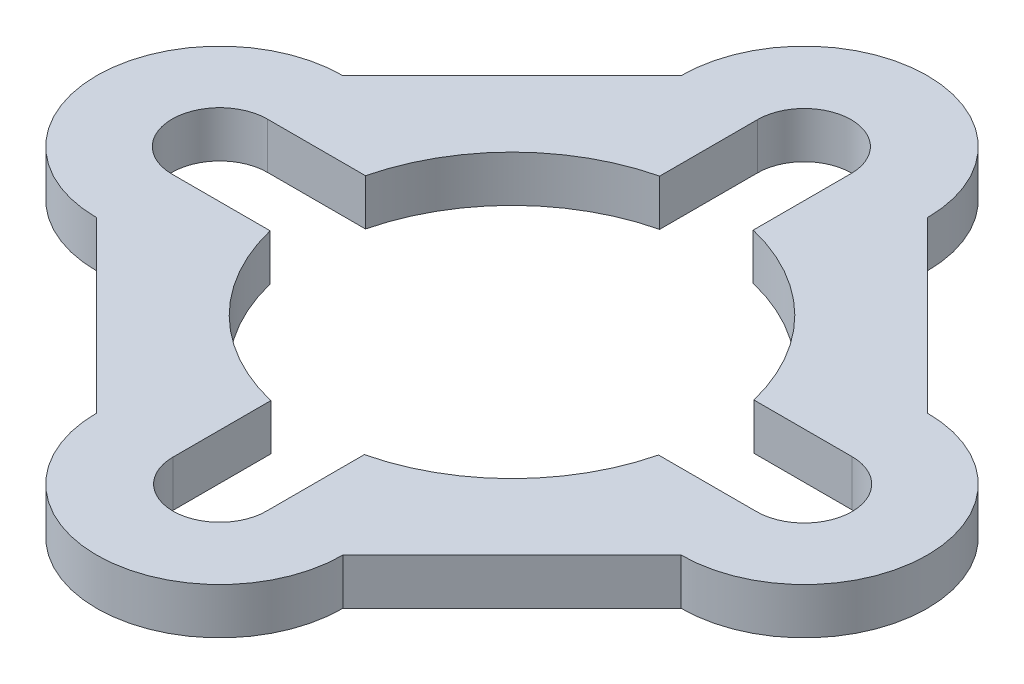
ISO-10303-21;
HEADER;
FILE_DESCRIPTION(('STEP AP214'),'2;1');
FILE_NAME('part.step','',(''),(''),'','','');
FILE_SCHEMA(('AUTOMOTIVE_DESIGN { 1 0 10303 214 1 1 1 1 }'));
ENDSEC;
DATA;
#1=APPLICATION_CONTEXT('core data for automotive mechanical design processes');
#2=APPLICATION_PROTOCOL_DEFINITION('international standard','automotive_design',2000,#1);
#3=PRODUCT_CONTEXT('',#1,'mechanical');
#4=PRODUCT('Part','Part','',(#3));
#5=PRODUCT_RELATED_PRODUCT_CATEGORY('part','',(#4));
#6=PRODUCT_DEFINITION_FORMATION('','',#4);
#7=PRODUCT_DEFINITION_CONTEXT('part definition',#1,'design');
#8=PRODUCT_DEFINITION('design','',#6,#7);
#9=PRODUCT_DEFINITION_SHAPE('','',#8);
#10=(LENGTH_UNIT() NAMED_UNIT(*) SI_UNIT(.MILLI.,.METRE.));
#11=(NAMED_UNIT(*) PLANE_ANGLE_UNIT() SI_UNIT($,.RADIAN.));
#12=(NAMED_UNIT(*) SI_UNIT($,.STERADIAN.) SOLID_ANGLE_UNIT());
#13=UNCERTAINTY_MEASURE_WITH_UNIT(LENGTH_MEASURE(1.E-05),#10,'distance_accuracy_value','');
#14=(GEOMETRIC_REPRESENTATION_CONTEXT(3) GLOBAL_UNCERTAINTY_ASSIGNED_CONTEXT((#13)) GLOBAL_UNIT_ASSIGNED_CONTEXT((#10,
#11,#12)) REPRESENTATION_CONTEXT('',''));
#15=CARTESIAN_POINT('',(0.,0.,0.));
#16=DIRECTION('',(0.,0.,1.));
#17=DIRECTION('',(1.,0.,0.));
#18=AXIS2_PLACEMENT_3D('',#15,#16,#17);
#19=CARTESIAN_POINT('',(6.75,1.5,6.75));
#20=DIRECTION('',(-0.707106781186548,0.,-0.707106781186547));
#21=DIRECTION('',(-0.707106781186547,0.,0.707106781186548));
#22=AXIS2_PLACEMENT_3D('',#19,#20,#21);
#23=PLANE('',#22);
#24=DIRECTION('',(0.707106781186547,0.,-0.707106781186548));
#25=VECTOR('',#24,1.);
#26=CARTESIAN_POINT('',(6.75,0.,6.75));
#27=LINE('',#26,#25);
#28=CARTESIAN_POINT('',(4.00000000000001,0.,9.5));
#29=VERTEX_POINT('',#28);
#30=CARTESIAN_POINT('',(9.5,0.,4.));
#31=VERTEX_POINT('',#30);
#32=EDGE_CURVE('E285',#29,#31,#27,.T.);
#33=ORIENTED_EDGE('',*,*,#32,.T.);
#34=DIRECTION('',(0.,-1.,0.));
#35=VECTOR('',#34,1.);
#36=CARTESIAN_POINT('',(9.5,1.5,4.));
#37=LINE('',#36,#35);
#38=CARTESIAN_POINT('',(9.5,1.5,4.));
#39=VERTEX_POINT('',#38);
#40=EDGE_CURVE('E11',#39,#31,#37,.T.);
#41=ORIENTED_EDGE('',*,*,#40,.F.);
#42=DIRECTION('',(0.707106781186547,0.,-0.707106781186548));
#43=VECTOR('',#42,1.);
#44=CARTESIAN_POINT('',(6.75,1.5,6.75));
#45=LINE('',#44,#43);
#46=CARTESIAN_POINT('',(4.00000000000001,1.5,9.5));
#47=VERTEX_POINT('',#46);
#48=EDGE_CURVE('E428',#47,#39,#45,.T.);
#49=ORIENTED_EDGE('',*,*,#48,.F.);
#50=DIRECTION('',(0.,-1.,0.));
#51=VECTOR('',#50,1.);
#52=CARTESIAN_POINT('',(4.00000000000001,1.5,9.5));
#53=LINE('',#52,#51);
#54=EDGE_CURVE('E308',#47,#29,#53,.T.);
#55=ORIENTED_EDGE('',*,*,#54,.T.);
#56=EDGE_LOOP('',(#33,#41,#49,#55));
#57=FACE_BOUND('',#56,.T.);
#58=ADVANCED_FACE('F41',(#57),#23,.F.);
#59=CARTESIAN_POINT('',(9.5,1.5,0.));
#60=DIRECTION('',(0.,-1.,0.));
#61=DIRECTION('',(0.,0.,-1.));
#62=AXIS2_PLACEMENT_3D('',#59,#60,#61);
#63=CYLINDRICAL_SURFACE('',#62,4.);
#64=CARTESIAN_POINT('',(9.5,0.,0.));
#65=DIRECTION('',(0.,1.,0.));
#66=DIRECTION('',(0.,0.,1.));
#67=AXIS2_PLACEMENT_3D('',#64,#65,#66);
#68=CIRCLE('',#67,4.);
#69=CARTESIAN_POINT('',(9.5,0.,-4.));
#70=VERTEX_POINT('',#69);
#71=EDGE_CURVE('E289',#31,#70,#68,.T.);
#72=ORIENTED_EDGE('',*,*,#71,.T.);
#73=DIRECTION('',(0.,-1.,0.));
#74=VECTOR('',#73,1.);
#75=CARTESIAN_POINT('',(9.5,1.5,-4.));
#76=LINE('',#75,#74);
#77=CARTESIAN_POINT('',(9.5,1.5,-4.));
#78=VERTEX_POINT('',#77);
#79=EDGE_CURVE('E52',#78,#70,#76,.T.);
#80=ORIENTED_EDGE('',*,*,#79,.F.);
#81=CARTESIAN_POINT('',(9.5,1.5,0.));
#82=DIRECTION('',(0.,1.,0.));
#83=DIRECTION('',(0.,0.,1.));
#84=AXIS2_PLACEMENT_3D('',#81,#82,#83);
#85=CIRCLE('',#84,4.);
#86=EDGE_CURVE('E431',#39,#78,#85,.T.);
#87=ORIENTED_EDGE('',*,*,#86,.F.);
#88=ORIENTED_EDGE('',*,*,#40,.T.);
#89=EDGE_LOOP('',(#72,#80,#87,#88));
#90=FACE_BOUND('',#89,.T.);
#91=ADVANCED_FACE('F501',(#90),#63,.T.);
#92=CARTESIAN_POINT('',(6.75,1.5,-6.75));
#93=DIRECTION('',(-0.707106781186548,0.,0.707106781186547));
#94=DIRECTION('',(0.707106781186547,0.,0.707106781186548));
#95=AXIS2_PLACEMENT_3D('',#92,#93,#94);
#96=PLANE('',#95);
#97=DIRECTION('',(-0.707106781186547,0.,-0.707106781186548));
#98=VECTOR('',#97,1.);
#99=CARTESIAN_POINT('',(6.75,0.,-6.75));
#100=LINE('',#99,#98);
#101=CARTESIAN_POINT('',(4.00000000000001,0.,-9.5));
#102=VERTEX_POINT('',#101);
#103=EDGE_CURVE('E292',#70,#102,#100,.T.);
#104=ORIENTED_EDGE('',*,*,#103,.T.);
#105=DIRECTION('',(0.,-1.,0.));
#106=VECTOR('',#105,1.);
#107=CARTESIAN_POINT('',(4.00000000000001,1.5,-9.5));
#108=LINE('',#107,#106);
#109=CARTESIAN_POINT('',(4.00000000000001,1.5,-9.5));
#110=VERTEX_POINT('',#109);
#111=EDGE_CURVE('E319',#110,#102,#108,.T.);
#112=ORIENTED_EDGE('',*,*,#111,.F.);
#113=DIRECTION('',(-0.707106781186547,0.,-0.707106781186548));
#114=VECTOR('',#113,1.);
#115=CARTESIAN_POINT('',(6.75,1.5,-6.75));
#116=LINE('',#115,#114);
#117=EDGE_CURVE('E434',#78,#110,#116,.T.);
#118=ORIENTED_EDGE('',*,*,#117,.F.);
#119=ORIENTED_EDGE('',*,*,#79,.T.);
#120=EDGE_LOOP('',(#104,#112,#118,#119));
#121=FACE_BOUND('',#120,.T.);
#122=ADVANCED_FACE('F507',(#121),#96,.F.);
#123=CARTESIAN_POINT('',(0.,1.5,-9.5));
#124=DIRECTION('',(0.,-1.,0.));
#125=DIRECTION('',(0.,0.,-1.));
#126=AXIS2_PLACEMENT_3D('',#123,#124,#125);
#127=CYLINDRICAL_SURFACE('',#126,4.);
#128=CARTESIAN_POINT('',(0.,0.,-9.5));
#129=DIRECTION('',(0.,1.,0.));
#130=DIRECTION('',(0.,0.,1.));
#131=AXIS2_PLACEMENT_3D('',#128,#129,#130);
#132=CIRCLE('',#131,4.);
#133=CARTESIAN_POINT('',(-4.,0.,-9.5));
#134=VERTEX_POINT('',#133);
#135=EDGE_CURVE('E295',#102,#134,#132,.T.);
#136=ORIENTED_EDGE('',*,*,#135,.T.);
#137=DIRECTION('',(0.,-1.,0.));
#138=VECTOR('',#137,1.);
#139=CARTESIAN_POINT('',(-4.,1.5,-9.5));
#140=LINE('',#139,#138);
#141=CARTESIAN_POINT('',(-4.,1.5,-9.5));
#142=VERTEX_POINT('',#141);
#143=EDGE_CURVE('E315',#142,#134,#140,.T.);
#144=ORIENTED_EDGE('',*,*,#143,.F.);
#145=CARTESIAN_POINT('',(0.,1.5,-9.5));
#146=DIRECTION('',(0.,1.,0.));
#147=DIRECTION('',(0.,0.,1.));
#148=AXIS2_PLACEMENT_3D('',#145,#146,#147);
#149=CIRCLE('',#148,4.);
#150=EDGE_CURVE('E437',#110,#142,#149,.T.);
#151=ORIENTED_EDGE('',*,*,#150,.F.);
#152=ORIENTED_EDGE('',*,*,#111,.T.);
#153=EDGE_LOOP('',(#136,#144,#151,#152));
#154=FACE_BOUND('',#153,.T.);
#155=ADVANCED_FACE('F556',(#154),#127,.T.);
#156=CARTESIAN_POINT('',(-6.75,1.5,-6.75));
#157=DIRECTION('',(0.707106781186547,0.,0.707106781186547));
#158=DIRECTION('',(0.707106781186548,0.,-0.707106781186548));
#159=AXIS2_PLACEMENT_3D('',#156,#157,#158);
#160=PLANE('',#159);
#161=DIRECTION('',(-0.707106781186548,0.,0.707106781186548));
#162=VECTOR('',#161,1.);
#163=CARTESIAN_POINT('',(-6.75,0.,-6.75));
#164=LINE('',#163,#162);
#165=CARTESIAN_POINT('',(-9.5,0.,-4.));
#166=VERTEX_POINT('',#165);
#167=EDGE_CURVE('E298',#134,#166,#164,.T.);
#168=ORIENTED_EDGE('',*,*,#167,.T.);
#169=DIRECTION('',(0.,-1.,0.));
#170=VECTOR('',#169,1.);
#171=CARTESIAN_POINT('',(-9.5,1.5,-4.));
#172=LINE('',#171,#170);
#173=CARTESIAN_POINT('',(-9.5,1.5,-4.));
#174=VERTEX_POINT('',#173);
#175=EDGE_CURVE('E231',#174,#166,#172,.T.);
#176=ORIENTED_EDGE('',*,*,#175,.F.);
#177=DIRECTION('',(-0.707106781186548,0.,0.707106781186548));
#178=VECTOR('',#177,1.);
#179=CARTESIAN_POINT('',(-6.75,1.5,-6.75));
#180=LINE('',#179,#178);
#181=EDGE_CURVE('E220',#142,#174,#180,.T.);
#182=ORIENTED_EDGE('',*,*,#181,.F.);
#183=ORIENTED_EDGE('',*,*,#143,.T.);
#184=EDGE_LOOP('',(#168,#176,#182,#183));
#185=FACE_BOUND('',#184,.T.);
#186=ADVANCED_FACE('F549',(#185),#160,.F.);
#187=CARTESIAN_POINT('',(-9.5,1.5,0.));
#188=DIRECTION('',(0.,-1.,0.));
#189=DIRECTION('',(0.,0.,-1.));
#190=AXIS2_PLACEMENT_3D('',#187,#188,#189);
#191=CYLINDRICAL_SURFACE('',#190,4.);
#192=CARTESIAN_POINT('',(-9.5,0.,0.));
#193=DIRECTION('',(0.,1.,0.));
#194=DIRECTION('',(0.,0.,1.));
#195=AXIS2_PLACEMENT_3D('',#192,#193,#194);
#196=CIRCLE('',#195,4.);
#197=CARTESIAN_POINT('',(-9.5,0.,4.));
#198=VERTEX_POINT('',#197);
#199=EDGE_CURVE('E229',#166,#198,#196,.T.);
#200=ORIENTED_EDGE('',*,*,#199,.T.);
#201=DIRECTION('',(0.,-1.,0.));
#202=VECTOR('',#201,1.);
#203=CARTESIAN_POINT('',(-9.5,1.5,4.));
#204=LINE('',#203,#202);
#205=CARTESIAN_POINT('',(-9.5,1.5,4.));
#206=VERTEX_POINT('',#205);
#207=EDGE_CURVE('E226',#206,#198,#204,.T.);
#208=ORIENTED_EDGE('',*,*,#207,.F.);
#209=CARTESIAN_POINT('',(-9.5,1.5,0.));
#210=DIRECTION('',(0.,1.,0.));
#211=DIRECTION('',(0.,0.,1.));
#212=AXIS2_PLACEMENT_3D('',#209,#210,#211);
#213=CIRCLE('',#212,4.);
#214=EDGE_CURVE('E214',#174,#206,#213,.T.);
#215=ORIENTED_EDGE('',*,*,#214,.F.);
#216=ORIENTED_EDGE('',*,*,#175,.T.);
#217=EDGE_LOOP('',(#200,#208,#215,#216));
#218=FACE_BOUND('',#217,.T.);
#219=ADVANCED_FACE('F227',(#218),#191,.T.);
#220=CARTESIAN_POINT('',(-6.75,1.5,6.75));
#221=DIRECTION('',(0.707106781186547,0.,-0.707106781186547));
#222=DIRECTION('',(-0.707106781186548,0.,-0.707106781186548));
#223=AXIS2_PLACEMENT_3D('',#220,#221,#222);
#224=PLANE('',#223);
#225=DIRECTION('',(0.707106781186548,0.,0.707106781186548));
#226=VECTOR('',#225,1.);
#227=CARTESIAN_POINT('',(-6.75,0.,6.75));
#228=LINE('',#227,#226);
#229=CARTESIAN_POINT('',(-4.,0.,9.5));
#230=VERTEX_POINT('',#229);
#231=EDGE_CURVE('E138',#198,#230,#228,.T.);
#232=ORIENTED_EDGE('',*,*,#231,.T.);
#233=DIRECTION('',(0.,-1.,0.));
#234=VECTOR('',#233,1.);
#235=CARTESIAN_POINT('',(-4.,1.5,9.5));
#236=LINE('',#235,#234);
#237=CARTESIAN_POINT('',(-4.,1.5,9.5));
#238=VERTEX_POINT('',#237);
#239=EDGE_CURVE('E232',#238,#230,#236,.T.);
#240=ORIENTED_EDGE('',*,*,#239,.F.);
#241=DIRECTION('',(0.707106781186548,0.,0.707106781186548));
#242=VECTOR('',#241,1.);
#243=CARTESIAN_POINT('',(-6.75,1.5,6.75));
#244=LINE('',#243,#242);
#245=EDGE_CURVE('E218',#206,#238,#244,.T.);
#246=ORIENTED_EDGE('',*,*,#245,.F.);
#247=ORIENTED_EDGE('',*,*,#207,.T.);
#248=EDGE_LOOP('',(#232,#240,#246,#247));
#249=FACE_BOUND('',#248,.T.);
#250=ADVANCED_FACE('F234',(#249),#224,.F.);
#251=CARTESIAN_POINT('',(0.,1.5,9.5));
#252=DIRECTION('',(0.,-1.,0.));
#253=DIRECTION('',(0.,0.,-1.));
#254=AXIS2_PLACEMENT_3D('',#251,#252,#253);
#255=CYLINDRICAL_SURFACE('',#254,1.52);
#256=CARTESIAN_POINT('',(0.,0.,9.5));
#257=DIRECTION('',(0.,1.,0.));
#258=DIRECTION('',(0.,0.,1.));
#259=AXIS2_PLACEMENT_3D('',#256,#257,#258);
#260=CIRCLE('',#259,1.52);
#261=CARTESIAN_POINT('',(-1.51999999999999,0.,9.5));
#262=VERTEX_POINT('',#261);
#263=CARTESIAN_POINT('',(1.52,0.,9.5));
#264=VERTEX_POINT('',#263);
#265=EDGE_CURVE('E242',#262,#264,#260,.T.);
#266=ORIENTED_EDGE('',*,*,#265,.F.);
#267=DIRECTION('',(0.,-1.,0.));
#268=VECTOR('',#267,1.);
#269=CARTESIAN_POINT('',(-1.51999999999999,1.5,9.5));
#270=LINE('',#269,#268);
#271=CARTESIAN_POINT('',(-1.51999999999999,1.5,9.5));
#272=VERTEX_POINT('',#271);
#273=EDGE_CURVE('E45',#272,#262,#270,.T.);
#274=ORIENTED_EDGE('',*,*,#273,.F.);
#275=CARTESIAN_POINT('',(0.,1.5,9.5));
#276=DIRECTION('',(0.,1.,0.));
#277=DIRECTION('',(0.,0.,1.));
#278=AXIS2_PLACEMENT_3D('',#275,#276,#277);
#279=CIRCLE('',#278,1.52);
#280=CARTESIAN_POINT('',(1.52,1.5,9.5));
#281=VERTEX_POINT('',#280);
#282=EDGE_CURVE('E307',#272,#281,#279,.T.);
#283=ORIENTED_EDGE('',*,*,#282,.T.);
#284=DIRECTION('',(0.,-1.,0.));
#285=VECTOR('',#284,1.);
#286=CARTESIAN_POINT('',(1.52,1.5,9.5));
#287=LINE('',#286,#285);
#288=EDGE_CURVE('E238',#281,#264,#287,.T.);
#289=ORIENTED_EDGE('',*,*,#288,.T.);
#290=EDGE_LOOP('',(#266,#274,#283,#289));
#291=FACE_BOUND('',#290,.T.);
#292=ADVANCED_FACE('F43',(#291),#255,.F.);
#293=CARTESIAN_POINT('',(-1.52,1.5,0.));
#294=DIRECTION('',(1.,0.,0.));
#295=DIRECTION('',(0.,0.,-1.));
#296=AXIS2_PLACEMENT_3D('',#293,#294,#295);
#297=PLANE('',#296);
#298=DIRECTION('',(0.,0.,1.));
#299=VECTOR('',#298,1.);
#300=CARTESIAN_POINT('',(-1.52,0.,0.));
#301=LINE('',#300,#299);
#302=CARTESIAN_POINT('',(-1.52,0.,6.31977847713035));
#303=VERTEX_POINT('',#302);
#304=EDGE_CURVE('E246',#303,#262,#301,.T.);
#305=ORIENTED_EDGE('',*,*,#304,.F.);
#306=DIRECTION('',(0.,-1.,0.));
#307=VECTOR('',#306,1.);
#308=CARTESIAN_POINT('',(-1.52,1.5,6.31977847713035));
#309=LINE('',#308,#307);
#310=CARTESIAN_POINT('',(-1.52,1.5,6.31977847713035));
#311=VERTEX_POINT('',#310);
#312=EDGE_CURVE('E366',#311,#303,#309,.T.);
#313=ORIENTED_EDGE('',*,*,#312,.F.);
#314=DIRECTION('',(0.,0.,1.));
#315=VECTOR('',#314,1.);
#316=CARTESIAN_POINT('',(-1.52,1.5,0.));
#317=LINE('',#316,#315);
#318=EDGE_CURVE('E377',#311,#272,#317,.T.);
#319=ORIENTED_EDGE('',*,*,#318,.T.);
#320=ORIENTED_EDGE('',*,*,#273,.T.);
#321=EDGE_LOOP('',(#305,#313,#319,#320));
#322=FACE_BOUND('',#321,.T.);
#323=ADVANCED_FACE('F375',(#322),#297,.T.);
#324=CARTESIAN_POINT('',(0.,1.5,0.));
#325=DIRECTION('',(0.,-1.,0.));
#326=DIRECTION('',(0.,0.,-1.));
#327=AXIS2_PLACEMENT_3D('',#324,#325,#326);
#328=CYLINDRICAL_SURFACE('',#327,6.5);
#329=CARTESIAN_POINT('',(0.,0.,0.));
#330=DIRECTION('',(0.,1.,0.));
#331=DIRECTION('',(0.,0.,1.));
#332=AXIS2_PLACEMENT_3D('',#329,#330,#331);
#333=CIRCLE('',#332,6.5);
#334=CARTESIAN_POINT('',(-6.31248762375024,0.,1.55));
#335=VERTEX_POINT('',#334);
#336=EDGE_CURVE('E250',#335,#303,#333,.T.);
#337=ORIENTED_EDGE('',*,*,#336,.F.);
#338=DIRECTION('',(0.,-1.,0.));
#339=VECTOR('',#338,1.);
#340=CARTESIAN_POINT('',(-6.31248762375024,1.5,1.55));
#341=LINE('',#340,#339);
#342=CARTESIAN_POINT('',(-6.31248762375024,1.5,1.55));
#343=VERTEX_POINT('',#342);
#344=EDGE_CURVE('E364',#343,#335,#341,.T.);
#345=ORIENTED_EDGE('',*,*,#344,.F.);
#346=CARTESIAN_POINT('',(0.,1.5,0.));
#347=DIRECTION('',(0.,1.,0.));
#348=DIRECTION('',(0.,0.,1.));
#349=AXIS2_PLACEMENT_3D('',#346,#347,#348);
#350=CIRCLE('',#349,6.5);
#351=EDGE_CURVE('E387',#343,#311,#350,.T.);
#352=ORIENTED_EDGE('',*,*,#351,.T.);
#353=ORIENTED_EDGE('',*,*,#312,.T.);
#354=EDGE_LOOP('',(#337,#345,#352,#353));
#355=FACE_BOUND('',#354,.T.);
#356=ADVANCED_FACE('F385',(#355),#328,.F.);
#357=CARTESIAN_POINT('',(0.,1.5,1.55));
#358=DIRECTION('',(0.,0.,-1.));
#359=DIRECTION('',(-1.,0.,0.));
#360=AXIS2_PLACEMENT_3D('',#357,#358,#359);
#361=PLANE('',#360);
#362=DIRECTION('',(1.,0.,0.));
#363=VECTOR('',#362,1.);
#364=CARTESIAN_POINT('',(0.,0.,1.55));
#365=LINE('',#364,#363);
#366=CARTESIAN_POINT('',(-9.5,0.,1.55));
#367=VERTEX_POINT('',#366);
#368=EDGE_CURVE('E255',#367,#335,#365,.T.);
#369=ORIENTED_EDGE('',*,*,#368,.F.);
#370=DIRECTION('',(0.,-1.,0.));
#371=VECTOR('',#370,1.);
#372=CARTESIAN_POINT('',(-9.5,1.5,1.55));
#373=LINE('',#372,#371);
#374=CARTESIAN_POINT('',(-9.5,1.5,1.55));
#375=VERTEX_POINT('',#374);
#376=EDGE_CURVE('E361',#375,#367,#373,.T.);
#377=ORIENTED_EDGE('',*,*,#376,.F.);
#378=DIRECTION('',(1.,0.,0.));
#379=VECTOR('',#378,1.);
#380=CARTESIAN_POINT('',(0.,1.5,1.55));
#381=LINE('',#380,#379);
#382=EDGE_CURVE('E393',#375,#343,#381,.T.);
#383=ORIENTED_EDGE('',*,*,#382,.T.);
#384=ORIENTED_EDGE('',*,*,#344,.T.);
#385=EDGE_LOOP('',(#369,#377,#383,#384));
#386=FACE_BOUND('',#385,.T.);
#387=ADVANCED_FACE('F399',(#386),#361,.T.);
#388=CARTESIAN_POINT('',(-9.5,1.5,0.));
#389=DIRECTION('',(0.,-1.,0.));
#390=DIRECTION('',(0.,0.,-1.));
#391=AXIS2_PLACEMENT_3D('',#388,#389,#390);
#392=CYLINDRICAL_SURFACE('',#391,1.55);
#393=CARTESIAN_POINT('',(-9.5,0.,0.));
#394=DIRECTION('',(0.,1.,0.));
#395=DIRECTION('',(0.,0.,1.));
#396=AXIS2_PLACEMENT_3D('',#393,#394,#395);
#397=CIRCLE('',#396,1.55);
#398=CARTESIAN_POINT('',(-9.5,0.,-1.55));
#399=VERTEX_POINT('',#398);
#400=EDGE_CURVE('E261',#399,#367,#397,.T.);
#401=ORIENTED_EDGE('',*,*,#400,.F.);
#402=DIRECTION('',(0.,-1.,0.));
#403=VECTOR('',#402,1.);
#404=CARTESIAN_POINT('',(-9.5,1.5,-1.55));
#405=LINE('',#404,#403);
#406=CARTESIAN_POINT('',(-9.5,1.5,-1.55));
#407=VERTEX_POINT('',#406);
#408=EDGE_CURVE('E358',#407,#399,#405,.T.);
#409=ORIENTED_EDGE('',*,*,#408,.F.);
#410=CARTESIAN_POINT('',(-9.5,1.5,0.));
#411=DIRECTION('',(0.,1.,0.));
#412=DIRECTION('',(0.,0.,1.));
#413=AXIS2_PLACEMENT_3D('',#410,#411,#412);
#414=CIRCLE('',#413,1.55);
#415=EDGE_CURVE('E401',#407,#375,#414,.T.);
#416=ORIENTED_EDGE('',*,*,#415,.T.);
#417=ORIENTED_EDGE('',*,*,#376,.T.);
#418=EDGE_LOOP('',(#401,#409,#416,#417));
#419=FACE_BOUND('',#418,.T.);
#420=ADVANCED_FACE('F489',(#419),#392,.F.);
#421=CARTESIAN_POINT('',(0.,1.5,-1.55));
#422=DIRECTION('',(0.,0.,-1.));
#423=DIRECTION('',(-1.,0.,0.));
#424=AXIS2_PLACEMENT_3D('',#421,#422,#423);
#425=PLANE('',#424);
#426=DIRECTION('',(1.,0.,0.));
#427=VECTOR('',#426,1.);
#428=CARTESIAN_POINT('',(0.,0.,-1.55));
#429=LINE('',#428,#427);
#430=CARTESIAN_POINT('',(-6.31248762375024,0.,-1.55));
#431=VERTEX_POINT('',#430);
#432=EDGE_CURVE('E266',#399,#431,#429,.T.);
#433=ORIENTED_EDGE('',*,*,#432,.T.);
#434=DIRECTION('',(0.,-1.,0.));
#435=VECTOR('',#434,1.);
#436=CARTESIAN_POINT('',(-6.31248762375024,1.5,-1.55));
#437=LINE('',#436,#435);
#438=CARTESIAN_POINT('',(-6.31248762375024,1.5,-1.55));
#439=VERTEX_POINT('',#438);
#440=EDGE_CURVE('E355',#439,#431,#437,.T.);
#441=ORIENTED_EDGE('',*,*,#440,.F.);
#442=DIRECTION('',(1.,0.,0.));
#443=VECTOR('',#442,1.);
#444=CARTESIAN_POINT('',(0.,1.5,-1.55));
#445=LINE('',#444,#443);
#446=EDGE_CURVE('E405',#407,#439,#445,.T.);
#447=ORIENTED_EDGE('',*,*,#446,.F.);
#448=ORIENTED_EDGE('',*,*,#408,.T.);
#449=EDGE_LOOP('',(#433,#441,#447,#448));
#450=FACE_BOUND('',#449,.T.);
#451=ADVANCED_FACE('F487',(#450),#425,.F.);
#452=CARTESIAN_POINT('',(-1.52,0.,-6.31977847713035));
#453=VERTEX_POINT('',#452);
#454=EDGE_CURVE('E257',#453,#431,#333,.T.);
#455=ORIENTED_EDGE('',*,*,#454,.F.);
#456=DIRECTION('',(0.,-1.,0.));
#457=VECTOR('',#456,1.);
#458=CARTESIAN_POINT('',(-1.52,1.5,-6.31977847713035));
#459=LINE('',#458,#457);
#460=CARTESIAN_POINT('',(-1.52,1.5,-6.31977847713035));
#461=VERTEX_POINT('',#460);
#462=EDGE_CURVE('E352',#461,#453,#459,.T.);
#463=ORIENTED_EDGE('',*,*,#462,.F.);
#464=EDGE_CURVE('E398',#461,#439,#350,.T.);
#465=ORIENTED_EDGE('',*,*,#464,.T.);
#466=ORIENTED_EDGE('',*,*,#440,.T.);
#467=EDGE_LOOP('',(#455,#463,#465,#466));
#468=FACE_BOUND('',#467,.T.);
#469=ADVANCED_FACE('F485',(#468),#328,.F.);
#470=CARTESIAN_POINT('',(-1.52,0.,-9.5));
#471=VERTEX_POINT('',#470);
#472=EDGE_CURVE('E251',#471,#453,#301,.T.);
#473=ORIENTED_EDGE('',*,*,#472,.F.);
#474=DIRECTION('',(0.,-1.,0.));
#475=VECTOR('',#474,1.);
#476=CARTESIAN_POINT('',(-1.52,1.5,-9.5));
#477=LINE('',#476,#475);
#478=CARTESIAN_POINT('',(-1.52,1.5,-9.5));
#479=VERTEX_POINT('',#478);
#480=EDGE_CURVE('E349',#479,#471,#477,.T.);
#481=ORIENTED_EDGE('',*,*,#480,.F.);
#482=EDGE_CURVE('E453',#479,#461,#317,.T.);
#483=ORIENTED_EDGE('',*,*,#482,.T.);
#484=ORIENTED_EDGE('',*,*,#462,.T.);
#485=EDGE_LOOP('',(#473,#481,#483,#484));
#486=FACE_BOUND('',#485,.T.);
#487=ADVANCED_FACE('F531',(#486),#297,.T.);
#488=CARTESIAN_POINT('',(0.,1.5,-9.5));
#489=DIRECTION('',(0.,-1.,0.));
#490=DIRECTION('',(0.,0.,-1.));
#491=AXIS2_PLACEMENT_3D('',#488,#489,#490);
#492=CYLINDRICAL_SURFACE('',#491,1.52);
#493=CARTESIAN_POINT('',(0.,0.,-9.5));
#494=DIRECTION('',(0.,1.,0.));
#495=DIRECTION('',(0.,0.,1.));
#496=AXIS2_PLACEMENT_3D('',#493,#494,#495);
#497=CIRCLE('',#496,1.52);
#498=CARTESIAN_POINT('',(1.51999999999999,0.,-9.5));
#499=VERTEX_POINT('',#498);
#500=EDGE_CURVE('E271',#499,#471,#497,.T.);
#501=ORIENTED_EDGE('',*,*,#500,.F.);
#502=DIRECTION('',(0.,-1.,0.));
#503=VECTOR('',#502,1.);
#504=CARTESIAN_POINT('',(1.51999999999999,1.5,-9.5));
#505=LINE('',#504,#503);
#506=CARTESIAN_POINT('',(1.51999999999999,1.5,-9.5));
#507=VERTEX_POINT('',#506);
#508=EDGE_CURVE('E346',#507,#499,#505,.T.);
#509=ORIENTED_EDGE('',*,*,#508,.F.);
#510=CARTESIAN_POINT('',(0.,1.5,-9.5));
#511=DIRECTION('',(0.,1.,0.));
#512=DIRECTION('',(0.,0.,1.));
#513=AXIS2_PLACEMENT_3D('',#510,#511,#512);
#514=CIRCLE('',#513,1.52);
#515=EDGE_CURVE('E444',#507,#479,#514,.T.);
#516=ORIENTED_EDGE('',*,*,#515,.T.);
#517=ORIENTED_EDGE('',*,*,#480,.T.);
#518=EDGE_LOOP('',(#501,#509,#516,#517));
#519=FACE_BOUND('',#518,.T.);
#520=ADVANCED_FACE('F529',(#519),#492,.F.);
#521=CARTESIAN_POINT('',(1.52,1.5,0.));
#522=DIRECTION('',(1.,0.,0.));
#523=DIRECTION('',(0.,0.,-1.));
#524=AXIS2_PLACEMENT_3D('',#521,#522,#523);
#525=PLANE('',#524);
#526=DIRECTION('',(0.,0.,1.));
#527=VECTOR('',#526,1.);
#528=CARTESIAN_POINT('',(1.52,0.,0.));
#529=LINE('',#528,#527);
#530=CARTESIAN_POINT('',(1.51999999999999,0.,-6.31977847713035));
#531=VERTEX_POINT('',#530);
#532=EDGE_CURVE('E275',#499,#531,#529,.T.);
#533=ORIENTED_EDGE('',*,*,#532,.T.);
#534=DIRECTION('',(0.,-1.,0.));
#535=VECTOR('',#534,1.);
#536=CARTESIAN_POINT('',(1.51999999999999,1.5,-6.31977847713035));
#537=LINE('',#536,#535);
#538=CARTESIAN_POINT('',(1.51999999999999,1.5,-6.31977847713035));
#539=VERTEX_POINT('',#538);
#540=EDGE_CURVE('E343',#539,#531,#537,.T.);
#541=ORIENTED_EDGE('',*,*,#540,.F.);
#542=DIRECTION('',(0.,0.,1.));
#543=VECTOR('',#542,1.);
#544=CARTESIAN_POINT('',(1.52,1.5,0.));
#545=LINE('',#544,#543);
#546=EDGE_CURVE('E426',#507,#539,#545,.T.);
#547=ORIENTED_EDGE('',*,*,#546,.F.);
#548=ORIENTED_EDGE('',*,*,#508,.T.);
#549=EDGE_LOOP('',(#533,#541,#547,#548));
#550=FACE_BOUND('',#549,.T.);
#551=ADVANCED_FACE('F518',(#550),#525,.F.);
#552=CARTESIAN_POINT('',(6.31248762375024,0.,-1.55));
#553=VERTEX_POINT('',#552);
#554=EDGE_CURVE('E279',#553,#531,#333,.T.);
#555=ORIENTED_EDGE('',*,*,#554,.F.);
#556=DIRECTION('',(0.,-1.,0.));
#557=VECTOR('',#556,1.);
#558=CARTESIAN_POINT('',(6.31248762375024,1.5,-1.55));
#559=LINE('',#558,#557);
#560=CARTESIAN_POINT('',(6.31248762375024,1.5,-1.55));
#561=VERTEX_POINT('',#560);
#562=EDGE_CURVE('E340',#561,#553,#559,.T.);
#563=ORIENTED_EDGE('',*,*,#562,.F.);
#564=EDGE_CURVE('E416',#561,#539,#350,.T.);
#565=ORIENTED_EDGE('',*,*,#564,.T.);
#566=ORIENTED_EDGE('',*,*,#540,.T.);
#567=EDGE_LOOP('',(#555,#563,#565,#566));
#568=FACE_BOUND('',#567,.T.);
#569=ADVANCED_FACE('F521',(#568),#328,.F.);
#570=CARTESIAN_POINT('',(9.5,0.,-1.55));
#571=VERTEX_POINT('',#570);
#572=EDGE_CURVE('E270',#553,#571,#429,.T.);
#573=ORIENTED_EDGE('',*,*,#572,.T.);
#574=DIRECTION('',(0.,-1.,0.));
#575=VECTOR('',#574,1.);
#576=CARTESIAN_POINT('',(9.5,1.5,-1.55));
#577=LINE('',#576,#575);
#578=CARTESIAN_POINT('',(9.5,1.5,-1.55));
#579=VERTEX_POINT('',#578);
#580=EDGE_CURVE('E337',#579,#571,#577,.T.);
#581=ORIENTED_EDGE('',*,*,#580,.F.);
#582=EDGE_CURVE('E418',#561,#579,#445,.T.);
#583=ORIENTED_EDGE('',*,*,#582,.F.);
#584=ORIENTED_EDGE('',*,*,#562,.T.);
#585=EDGE_LOOP('',(#573,#581,#583,#584));
#586=FACE_BOUND('',#585,.T.);
#587=ADVANCED_FACE('F496',(#586),#425,.F.);
#588=CARTESIAN_POINT('',(9.5,1.5,0.));
#589=DIRECTION('',(0.,-1.,0.));
#590=DIRECTION('',(0.,0.,-1.));
#591=AXIS2_PLACEMENT_3D('',#588,#589,#590);
#592=CYLINDRICAL_SURFACE('',#591,1.55);
#593=CARTESIAN_POINT('',(9.5,0.,0.));
#594=DIRECTION('',(0.,1.,0.));
#595=DIRECTION('',(0.,0.,1.));
#596=AXIS2_PLACEMENT_3D('',#593,#594,#595);
#597=CIRCLE('',#596,1.55);
#598=CARTESIAN_POINT('',(9.5,0.,1.55));
#599=VERTEX_POINT('',#598);
#600=EDGE_CURVE('E281',#599,#571,#597,.T.);
#601=ORIENTED_EDGE('',*,*,#600,.F.);
#602=DIRECTION('',(0.,-1.,0.));
#603=VECTOR('',#602,1.);
#604=CARTESIAN_POINT('',(9.5,1.5,1.55));
#605=LINE('',#604,#603);
#606=CARTESIAN_POINT('',(9.5,1.5,1.55));
#607=VERTEX_POINT('',#606);
#608=EDGE_CURVE('E334',#607,#599,#605,.T.);
#609=ORIENTED_EDGE('',*,*,#608,.F.);
#610=CARTESIAN_POINT('',(9.5,1.5,0.));
#611=DIRECTION('',(0.,1.,0.));
#612=DIRECTION('',(0.,0.,1.));
#613=AXIS2_PLACEMENT_3D('',#610,#611,#612);
#614=CIRCLE('',#613,1.55);
#615=EDGE_CURVE('E409',#607,#579,#614,.T.);
#616=ORIENTED_EDGE('',*,*,#615,.T.);
#617=ORIENTED_EDGE('',*,*,#580,.T.);
#618=EDGE_LOOP('',(#601,#609,#616,#617));
#619=FACE_BOUND('',#618,.T.);
#620=ADVANCED_FACE('F524',(#619),#592,.F.);
#621=CARTESIAN_POINT('',(6.31248762375024,0.,1.55));
#622=VERTEX_POINT('',#621);
#623=EDGE_CURVE('E262',#622,#599,#365,.T.);
#624=ORIENTED_EDGE('',*,*,#623,.F.);
#625=DIRECTION('',(0.,-1.,0.));
#626=VECTOR('',#625,1.);
#627=CARTESIAN_POINT('',(6.31248762375024,1.5,1.55));
#628=LINE('',#627,#626);
#629=CARTESIAN_POINT('',(6.31248762375024,1.5,1.55));
#630=VERTEX_POINT('',#629);
#631=EDGE_CURVE('E331',#630,#622,#628,.T.);
#632=ORIENTED_EDGE('',*,*,#631,.F.);
#633=EDGE_CURVE('E403',#630,#607,#381,.T.);
#634=ORIENTED_EDGE('',*,*,#633,.T.);
#635=ORIENTED_EDGE('',*,*,#608,.T.);
#636=EDGE_LOOP('',(#624,#632,#634,#635));
#637=FACE_BOUND('',#636,.T.);
#638=ADVANCED_FACE('F498',(#637),#361,.T.);
#639=CARTESIAN_POINT('',(1.52,0.,6.31977847713035));
#640=VERTEX_POINT('',#639);
#641=EDGE_CURVE('E256',#640,#622,#333,.T.);
#642=ORIENTED_EDGE('',*,*,#641,.F.);
#643=DIRECTION('',(0.,-1.,0.));
#644=VECTOR('',#643,1.);
#645=CARTESIAN_POINT('',(1.52,1.5,6.31977847713035));
#646=LINE('',#645,#644);
#647=CARTESIAN_POINT('',(1.52,1.5,6.31977847713035));
#648=VERTEX_POINT('',#647);
#649=EDGE_CURVE('E328',#648,#640,#646,.T.);
#650=ORIENTED_EDGE('',*,*,#649,.F.);
#651=EDGE_CURVE('E397',#648,#630,#350,.T.);
#652=ORIENTED_EDGE('',*,*,#651,.T.);
#653=ORIENTED_EDGE('',*,*,#631,.T.);
#654=EDGE_LOOP('',(#642,#650,#652,#653));
#655=FACE_BOUND('',#654,.T.);
#656=ADVANCED_FACE('F516',(#655),#328,.F.);
#657=EDGE_CURVE('E280',#640,#264,#529,.T.);
#658=ORIENTED_EDGE('',*,*,#657,.T.);
#659=ORIENTED_EDGE('',*,*,#288,.F.);
#660=EDGE_CURVE('E415',#648,#281,#545,.T.);
#661=ORIENTED_EDGE('',*,*,#660,.F.);
#662=ORIENTED_EDGE('',*,*,#649,.T.);
#663=EDGE_LOOP('',(#658,#659,#661,#662));
#664=FACE_BOUND('',#663,.T.);
#665=ADVANCED_FACE('F512',(#664),#525,.F.);
#666=CARTESIAN_POINT('',(0.,1.5,9.5));
#667=DIRECTION('',(0.,-1.,0.));
#668=DIRECTION('',(0.,0.,-1.));
#669=AXIS2_PLACEMENT_3D('',#666,#667,#668);
#670=CYLINDRICAL_SURFACE('',#669,4.);
#671=CARTESIAN_POINT('',(0.,0.,9.5));
#672=DIRECTION('',(0.,1.,0.));
#673=DIRECTION('',(0.,0.,1.));
#674=AXIS2_PLACEMENT_3D('',#671,#672,#673);
#675=CIRCLE('',#674,4.);
#676=EDGE_CURVE('E144',#230,#29,#675,.T.);
#677=ORIENTED_EDGE('',*,*,#676,.T.);
#678=ORIENTED_EDGE('',*,*,#54,.F.);
#679=CARTESIAN_POINT('',(0.,1.5,9.5));
#680=DIRECTION('',(0.,1.,0.));
#681=DIRECTION('',(0.,0.,1.));
#682=AXIS2_PLACEMENT_3D('',#679,#680,#681);
#683=CIRCLE('',#682,4.);
#684=EDGE_CURVE('E61',#238,#47,#683,.T.);
#685=ORIENTED_EDGE('',*,*,#684,.F.);
#686=ORIENTED_EDGE('',*,*,#239,.T.);
#687=EDGE_LOOP('',(#677,#678,#685,#686));
#688=FACE_BOUND('',#687,.T.);
#689=ADVANCED_FACE('F515',(#688),#670,.T.);
#690=CARTESIAN_POINT('',(0.,1.5,0.));
#691=DIRECTION('',(0.,1.,0.));
#692=DIRECTION('',(0.,0.,1.));
#693=AXIS2_PLACEMENT_3D('',#690,#691,#692);
#694=PLANE('',#693);
#695=ORIENTED_EDGE('',*,*,#282,.F.);
#696=ORIENTED_EDGE('',*,*,#318,.F.);
#697=ORIENTED_EDGE('',*,*,#351,.F.);
#698=ORIENTED_EDGE('',*,*,#382,.F.);
#699=ORIENTED_EDGE('',*,*,#415,.F.);
#700=ORIENTED_EDGE('',*,*,#446,.T.);
#701=ORIENTED_EDGE('',*,*,#464,.F.);
#702=ORIENTED_EDGE('',*,*,#482,.F.);
#703=ORIENTED_EDGE('',*,*,#515,.F.);
#704=ORIENTED_EDGE('',*,*,#546,.T.);
#705=ORIENTED_EDGE('',*,*,#564,.F.);
#706=ORIENTED_EDGE('',*,*,#582,.T.);
#707=ORIENTED_EDGE('',*,*,#615,.F.);
#708=ORIENTED_EDGE('',*,*,#633,.F.);
#709=ORIENTED_EDGE('',*,*,#651,.F.);
#710=ORIENTED_EDGE('',*,*,#660,.T.);
#711=EDGE_LOOP('',(#695,#696,#697,#698,#699,#700,#701,#702,#703,#704,#705,#706,#707,#708,#709,#710));
#712=FACE_BOUND('',#711,.T.);
#713=ORIENTED_EDGE('',*,*,#48,.T.);
#714=ORIENTED_EDGE('',*,*,#86,.T.);
#715=ORIENTED_EDGE('',*,*,#117,.T.);
#716=ORIENTED_EDGE('',*,*,#150,.T.);
#717=ORIENTED_EDGE('',*,*,#181,.T.);
#718=ORIENTED_EDGE('',*,*,#214,.T.);
#719=ORIENTED_EDGE('',*,*,#245,.T.);
#720=ORIENTED_EDGE('',*,*,#684,.T.);
#721=EDGE_LOOP('',(#713,#714,#715,#716,#717,#718,#719,#720));
#722=FACE_BOUND('',#721,.T.);
#723=ADVANCED_FACE('F216',(#712,#722),#694,.T.);
#724=CARTESIAN_POINT('',(0.,0.,0.));
#725=DIRECTION('',(0.,1.,0.));
#726=DIRECTION('',(0.,0.,1.));
#727=AXIS2_PLACEMENT_3D('',#724,#725,#726);
#728=PLANE('',#727);
#729=ORIENTED_EDGE('',*,*,#265,.T.);
#730=ORIENTED_EDGE('',*,*,#657,.F.);
#731=ORIENTED_EDGE('',*,*,#641,.T.);
#732=ORIENTED_EDGE('',*,*,#623,.T.);
#733=ORIENTED_EDGE('',*,*,#600,.T.);
#734=ORIENTED_EDGE('',*,*,#572,.F.);
#735=ORIENTED_EDGE('',*,*,#554,.T.);
#736=ORIENTED_EDGE('',*,*,#532,.F.);
#737=ORIENTED_EDGE('',*,*,#500,.T.);
#738=ORIENTED_EDGE('',*,*,#472,.T.);
#739=ORIENTED_EDGE('',*,*,#454,.T.);
#740=ORIENTED_EDGE('',*,*,#432,.F.);
#741=ORIENTED_EDGE('',*,*,#400,.T.);
#742=ORIENTED_EDGE('',*,*,#368,.T.);
#743=ORIENTED_EDGE('',*,*,#336,.T.);
#744=ORIENTED_EDGE('',*,*,#304,.T.);
#745=EDGE_LOOP('',(#729,#730,#731,#732,#733,#734,#735,#736,#737,#738,#739,#740,#741,#742,#743,#744));
#746=FACE_BOUND('',#745,.T.);
#747=ORIENTED_EDGE('',*,*,#32,.F.);
#748=ORIENTED_EDGE('',*,*,#676,.F.);
#749=ORIENTED_EDGE('',*,*,#231,.F.);
#750=ORIENTED_EDGE('',*,*,#199,.F.);
#751=ORIENTED_EDGE('',*,*,#167,.F.);
#752=ORIENTED_EDGE('',*,*,#135,.F.);
#753=ORIENTED_EDGE('',*,*,#103,.F.);
#754=ORIENTED_EDGE('',*,*,#71,.F.);
#755=EDGE_LOOP('',(#747,#748,#749,#750,#751,#752,#753,#754));
#756=FACE_BOUND('',#755,.T.);
#757=ADVANCED_FACE('F382',(#746,#756),#728,.F.);
#758=CLOSED_SHELL('',(#58,#91,#122,#155,#186,#219,#250,#292,#323,#356,#387,#420,#451,#469,#487,
#520,#551,#569,#587,#620,#638,#656,#665,#689,#723,#757));
#759=MANIFOLD_SOLID_BREP('B2',#758);
#760=ADVANCED_BREP_SHAPE_REPRESENTATION('',(#18,#759),#14);
#761=SHAPE_DEFINITION_REPRESENTATION(#9,#760);
ENDSEC;
END-ISO-10303-21;
